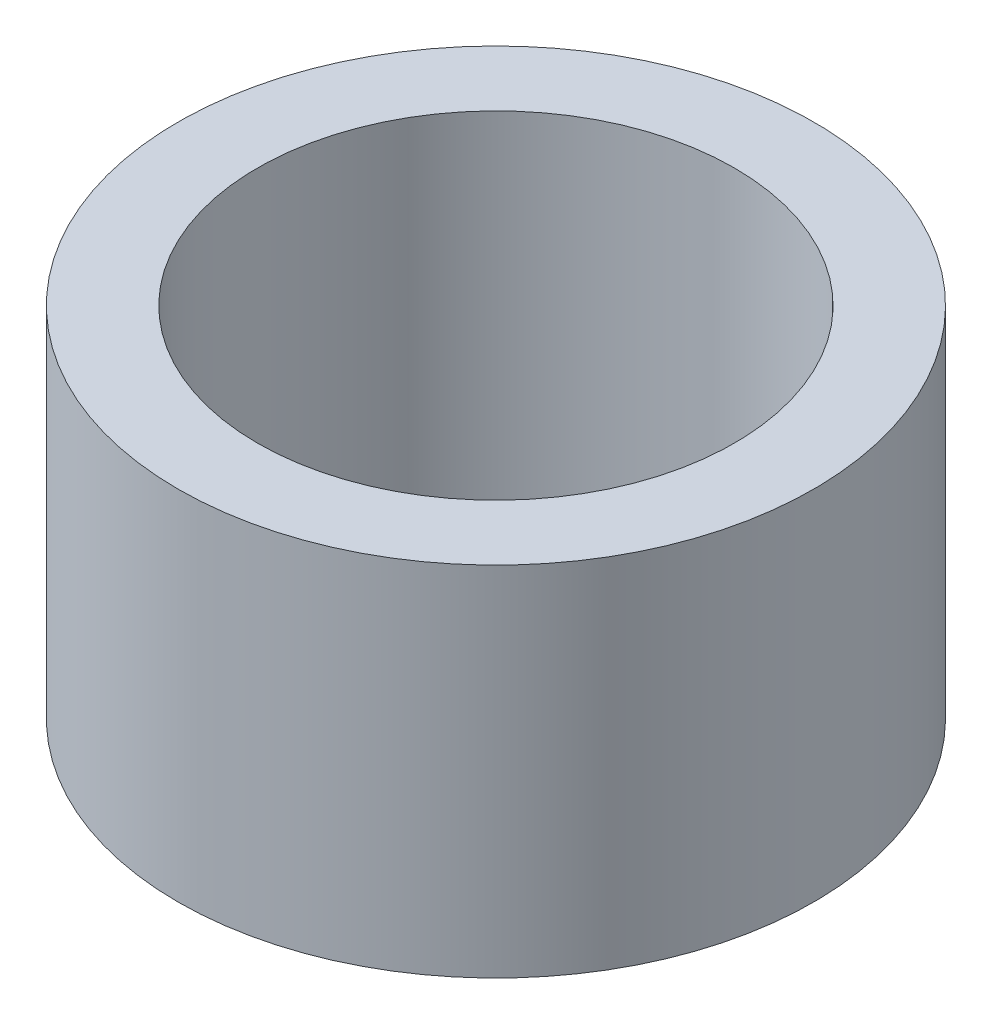
ISO-10303-21;
HEADER;
FILE_DESCRIPTION(('STEP AP214'),'2;1');
FILE_NAME('part.step','',(''),(''),'','','');
FILE_SCHEMA(('AUTOMOTIVE_DESIGN { 1 0 10303 214 1 1 1 1 }'));
ENDSEC;
DATA;
#1=APPLICATION_CONTEXT('core data for automotive mechanical design processes');
#2=APPLICATION_PROTOCOL_DEFINITION('international standard','automotive_design',2000,#1);
#3=PRODUCT_CONTEXT('',#1,'mechanical');
#4=PRODUCT('Part','Part','',(#3));
#5=PRODUCT_RELATED_PRODUCT_CATEGORY('part','',(#4));
#6=PRODUCT_DEFINITION_FORMATION('','',#4);
#7=PRODUCT_DEFINITION_CONTEXT('part definition',#1,'design');
#8=PRODUCT_DEFINITION('design','',#6,#7);
#9=PRODUCT_DEFINITION_SHAPE('','',#8);
#10=(LENGTH_UNIT() NAMED_UNIT(*) SI_UNIT(.MILLI.,.METRE.));
#11=(NAMED_UNIT(*) PLANE_ANGLE_UNIT() SI_UNIT($,.RADIAN.));
#12=(NAMED_UNIT(*) SI_UNIT($,.STERADIAN.) SOLID_ANGLE_UNIT());
#13=UNCERTAINTY_MEASURE_WITH_UNIT(LENGTH_MEASURE(1.E-05),#10,'distance_accuracy_value','');
#14=(GEOMETRIC_REPRESENTATION_CONTEXT(3) GLOBAL_UNCERTAINTY_ASSIGNED_CONTEXT((#13)) GLOBAL_UNIT_ASSIGNED_CONTEXT((#10,
#11,#12)) REPRESENTATION_CONTEXT('',''));
#15=CARTESIAN_POINT('',(0.,0.,0.));
#16=DIRECTION('',(0.,0.,1.));
#17=DIRECTION('',(1.,0.,0.));
#18=AXIS2_PLACEMENT_3D('',#15,#16,#17);
#19=CARTESIAN_POINT('',(0.,4.5,0.));
#20=DIRECTION('',(0.,1.,0.));
#21=DIRECTION('',(0.,0.,1.));
#22=AXIS2_PLACEMENT_3D('',#19,#20,#21);
#23=PLANE('',#22);
#24=CARTESIAN_POINT('',(0.,4.5,0.));
#25=DIRECTION('',(0.,1.,0.));
#26=DIRECTION('',(0.,0.,1.));
#27=AXIS2_PLACEMENT_3D('',#24,#25,#26);
#28=CIRCLE('',#27,4.);
#29=CARTESIAN_POINT('',(0.,4.5,4.));
#30=VERTEX_POINT('',#29);
#31=EDGE_CURVE('E10',#30,#30,#28,.T.);
#32=ORIENTED_EDGE('',*,*,#31,.T.);
#33=EDGE_LOOP('',(#32));
#34=FACE_BOUND('',#33,.T.);
#35=CARTESIAN_POINT('',(0.,4.5,0.));
#36=DIRECTION('',(0.,1.,0.));
#37=DIRECTION('',(0.,0.,1.));
#38=AXIS2_PLACEMENT_3D('',#35,#36,#37);
#39=CIRCLE('',#38,3.);
#40=CARTESIAN_POINT('',(0.,4.5,3.));
#41=VERTEX_POINT('',#40);
#42=EDGE_CURVE('E56',#41,#41,#39,.T.);
#43=ORIENTED_EDGE('',*,*,#42,.F.);
#44=EDGE_LOOP('',(#43));
#45=FACE_BOUND('',#44,.T.);
#46=ADVANCED_FACE('F43',(#34,#45),#23,.T.);
#47=CARTESIAN_POINT('',(0.,0.,0.));
#48=DIRECTION('',(0.,1.,0.));
#49=DIRECTION('',(0.,0.,1.));
#50=AXIS2_PLACEMENT_3D('',#47,#48,#49);
#51=PLANE('',#50);
#52=CARTESIAN_POINT('',(0.,0.,0.));
#53=DIRECTION('',(0.,1.,0.));
#54=DIRECTION('',(0.,0.,1.));
#55=AXIS2_PLACEMENT_3D('',#52,#53,#54);
#56=CIRCLE('',#55,4.);
#57=CARTESIAN_POINT('',(0.,0.,4.));
#58=VERTEX_POINT('',#57);
#59=EDGE_CURVE('E47',#58,#58,#56,.T.);
#60=ORIENTED_EDGE('',*,*,#59,.F.);
#61=EDGE_LOOP('',(#60));
#62=FACE_BOUND('',#61,.T.);
#63=CARTESIAN_POINT('',(0.,0.,0.));
#64=DIRECTION('',(0.,1.,0.));
#65=DIRECTION('',(0.,0.,1.));
#66=AXIS2_PLACEMENT_3D('',#63,#64,#65);
#67=CIRCLE('',#66,3.);
#68=CARTESIAN_POINT('',(0.,0.,3.));
#69=VERTEX_POINT('',#68);
#70=EDGE_CURVE('E58',#69,#69,#67,.T.);
#71=ORIENTED_EDGE('',*,*,#70,.T.);
#72=EDGE_LOOP('',(#71));
#73=FACE_BOUND('',#72,.T.);
#74=ADVANCED_FACE('F70',(#62,#73),#51,.F.);
#75=CARTESIAN_POINT('',(0.,4.5,0.));
#76=DIRECTION('',(0.,-1.,0.));
#77=DIRECTION('',(0.,0.,-1.));
#78=AXIS2_PLACEMENT_3D('',#75,#76,#77);
#79=CYLINDRICAL_SURFACE('',#78,4.);
#80=ORIENTED_EDGE('',*,*,#31,.F.);
#81=EDGE_LOOP('',(#80));
#82=FACE_BOUND('',#81,.T.);
#83=ORIENTED_EDGE('',*,*,#59,.T.);
#84=EDGE_LOOP('',(#83));
#85=FACE_BOUND('',#84,.T.);
#86=ADVANCED_FACE('F45',(#82,#85),#79,.T.);
#87=CARTESIAN_POINT('',(0.,4.5,0.));
#88=DIRECTION('',(0.,-1.,0.));
#89=DIRECTION('',(0.,0.,-1.));
#90=AXIS2_PLACEMENT_3D('',#87,#88,#89);
#91=CYLINDRICAL_SURFACE('',#90,3.);
#92=ORIENTED_EDGE('',*,*,#42,.T.);
#93=EDGE_LOOP('',(#92));
#94=FACE_BOUND('',#93,.T.);
#95=ORIENTED_EDGE('',*,*,#70,.F.);
#96=EDGE_LOOP('',(#95));
#97=FACE_BOUND('',#96,.T.);
#98=ADVANCED_FACE('F66',(#94,#97),#91,.F.);
#99=CLOSED_SHELL('',(#46,#74,#86,#98));
#100=MANIFOLD_SOLID_BREP('B2',#99);
#101=ADVANCED_BREP_SHAPE_REPRESENTATION('',(#18,#100),#14);
#102=SHAPE_DEFINITION_REPRESENTATION(#9,#101);
ENDSEC;
END-ISO-10303-21;
